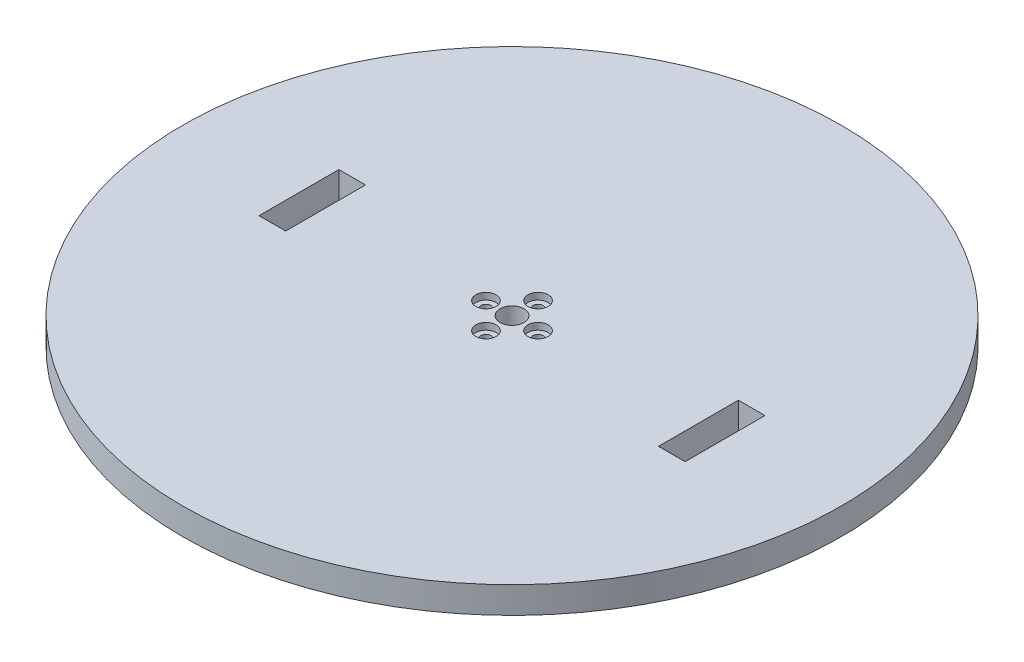
ISO-10303-21;
HEADER;
FILE_DESCRIPTION(('STEP AP214'),'2;1');
FILE_NAME('part.step','',(''),(''),'','','');
FILE_SCHEMA(('AUTOMOTIVE_DESIGN { 1 0 10303 214 1 1 1 1 }'));
ENDSEC;
DATA;
#1=APPLICATION_CONTEXT('core data for automotive mechanical design processes');
#2=APPLICATION_PROTOCOL_DEFINITION('international standard','automotive_design',2000,#1);
#3=PRODUCT_CONTEXT('',#1,'mechanical');
#4=PRODUCT('Part','Part','',(#3));
#5=PRODUCT_RELATED_PRODUCT_CATEGORY('part','',(#4));
#6=PRODUCT_DEFINITION_FORMATION('','',#4);
#7=PRODUCT_DEFINITION_CONTEXT('part definition',#1,'design');
#8=PRODUCT_DEFINITION('design','',#6,#7);
#9=PRODUCT_DEFINITION_SHAPE('','',#8);
#10=(LENGTH_UNIT() NAMED_UNIT(*) SI_UNIT(.MILLI.,.METRE.));
#11=(NAMED_UNIT(*) PLANE_ANGLE_UNIT() SI_UNIT($,.RADIAN.));
#12=(NAMED_UNIT(*) SI_UNIT($,.STERADIAN.) SOLID_ANGLE_UNIT());
#13=UNCERTAINTY_MEASURE_WITH_UNIT(LENGTH_MEASURE(1.E-05),#10,'distance_accuracy_value','');
#14=(GEOMETRIC_REPRESENTATION_CONTEXT(3) GLOBAL_UNCERTAINTY_ASSIGNED_CONTEXT((#13)) GLOBAL_UNIT_ASSIGNED_CONTEXT((#10,
#11,#12)) REPRESENTATION_CONTEXT('',''));
#15=CARTESIAN_POINT('',(0.,0.,0.));
#16=DIRECTION('',(0.,0.,1.));
#17=DIRECTION('',(1.,0.,0.));
#18=AXIS2_PLACEMENT_3D('',#15,#16,#17);
#19=CARTESIAN_POINT('',(-9.779,0.,-1.02429588037641E-13));
#20=DIRECTION('',(0.,1.,0.));
#21=DIRECTION('',(0.,0.,1.));
#22=AXIS2_PLACEMENT_3D('',#19,#20,#21);
#23=CYLINDRICAL_SURFACE('',#22,1.905);
#24=CARTESIAN_POINT('',(-9.779,0.,-1.02429588037641E-13));
#25=DIRECTION('',(0.,1.,0.));
#26=DIRECTION('',(1.,0.,0.));
#27=AXIS2_PLACEMENT_3D('',#24,#25,#26);
#28=CIRCLE('',#27,1.905);
#29=CARTESIAN_POINT('',(-7.874,0.,0.));
#30=VERTEX_POINT('',#29);
#31=EDGE_CURVE('E242',#30,#30,#28,.T.);
#32=ORIENTED_EDGE('',*,*,#31,.F.);
#33=EDGE_LOOP('',(#32));
#34=FACE_BOUND('',#33,.T.);
#35=CARTESIAN_POINT('',(-9.779,7.46,-1.02429588037641E-13));
#36=DIRECTION('',(0.,1.,0.));
#37=DIRECTION('',(0.,0.,1.));
#38=AXIS2_PLACEMENT_3D('',#35,#36,#37);
#39=CIRCLE('',#38,1.905);
#40=CARTESIAN_POINT('',(-9.779,7.46,1.9049999999999));
#41=VERTEX_POINT('',#40);
#42=EDGE_CURVE('E47',#41,#41,#39,.F.);
#43=ORIENTED_EDGE('',*,*,#42,.F.);
#44=EDGE_LOOP('',(#43));
#45=FACE_BOUND('',#44,.T.);
#46=ADVANCED_FACE('F43',(#34,#45),#23,.F.);
#47=CARTESIAN_POINT('',(0.,0.,9.779));
#48=DIRECTION('',(0.,1.,0.));
#49=DIRECTION('',(0.,0.,1.));
#50=AXIS2_PLACEMENT_3D('',#47,#48,#49);
#51=CYLINDRICAL_SURFACE('',#50,1.905);
#52=CARTESIAN_POINT('',(0.,0.,9.779));
#53=DIRECTION('',(0.,1.,0.));
#54=DIRECTION('',(0.,0.,-1.));
#55=AXIS2_PLACEMENT_3D('',#52,#53,#54);
#56=CIRCLE('',#55,1.905);
#57=CARTESIAN_POINT('',(0.,0.,7.874));
#58=VERTEX_POINT('',#57);
#59=EDGE_CURVE('E252',#58,#58,#56,.T.);
#60=ORIENTED_EDGE('',*,*,#59,.F.);
#61=EDGE_LOOP('',(#60));
#62=FACE_BOUND('',#61,.T.);
#63=CARTESIAN_POINT('',(0.,7.46,9.779));
#64=DIRECTION('',(0.,1.,0.));
#65=DIRECTION('',(0.,0.,1.));
#66=AXIS2_PLACEMENT_3D('',#63,#64,#65);
#67=CIRCLE('',#66,1.905);
#68=CARTESIAN_POINT('',(0.,7.46,11.684));
#69=VERTEX_POINT('',#68);
#70=EDGE_CURVE('E270',#69,#69,#67,.F.);
#71=ORIENTED_EDGE('',*,*,#70,.F.);
#72=EDGE_LOOP('',(#71));
#73=FACE_BOUND('',#72,.T.);
#74=ADVANCED_FACE('F282',(#62,#73),#51,.F.);
#75=CARTESIAN_POINT('',(9.779,0.,0.));
#76=DIRECTION('',(0.,1.,0.));
#77=DIRECTION('',(0.,0.,1.));
#78=AXIS2_PLACEMENT_3D('',#75,#76,#77);
#79=CYLINDRICAL_SURFACE('',#78,1.905);
#80=CARTESIAN_POINT('',(9.779,0.,0.));
#81=DIRECTION('',(0.,1.,0.));
#82=DIRECTION('',(-1.,0.,0.));
#83=AXIS2_PLACEMENT_3D('',#80,#81,#82);
#84=CIRCLE('',#83,1.905);
#85=CARTESIAN_POINT('',(7.874,0.,0.));
#86=VERTEX_POINT('',#85);
#87=EDGE_CURVE('E247',#86,#86,#84,.T.);
#88=ORIENTED_EDGE('',*,*,#87,.F.);
#89=EDGE_LOOP('',(#88));
#90=FACE_BOUND('',#89,.T.);
#91=CARTESIAN_POINT('',(9.779,7.46,0.));
#92=DIRECTION('',(0.,1.,0.));
#93=DIRECTION('',(0.,0.,1.));
#94=AXIS2_PLACEMENT_3D('',#91,#92,#93);
#95=CIRCLE('',#94,1.905);
#96=CARTESIAN_POINT('',(9.779,7.46,1.90500000000003));
#97=VERTEX_POINT('',#96);
#98=EDGE_CURVE('E209',#97,#97,#95,.F.);
#99=ORIENTED_EDGE('',*,*,#98,.F.);
#100=EDGE_LOOP('',(#99));
#101=FACE_BOUND('',#100,.T.);
#102=ADVANCED_FACE('F288',(#90,#101),#79,.F.);
#103=CARTESIAN_POINT('',(0.,0.,-9.779));
#104=DIRECTION('',(0.,1.,0.));
#105=DIRECTION('',(0.,0.,1.));
#106=AXIS2_PLACEMENT_3D('',#103,#104,#105);
#107=CYLINDRICAL_SURFACE('',#106,1.905);
#108=CARTESIAN_POINT('',(0.,0.,-9.779));
#109=DIRECTION('',(0.,1.,0.));
#110=DIRECTION('',(0.,0.,1.));
#111=AXIS2_PLACEMENT_3D('',#108,#109,#110);
#112=CIRCLE('',#111,1.905);
#113=CARTESIAN_POINT('',(0.,0.,-7.874));
#114=VERTEX_POINT('',#113);
#115=EDGE_CURVE('E251',#114,#114,#112,.T.);
#116=ORIENTED_EDGE('',*,*,#115,.F.);
#117=EDGE_LOOP('',(#116));
#118=FACE_BOUND('',#117,.T.);
#119=CARTESIAN_POINT('',(0.,7.46,-9.779));
#120=DIRECTION('',(0.,1.,0.));
#121=DIRECTION('',(0.,0.,1.));
#122=AXIS2_PLACEMENT_3D('',#119,#120,#121);
#123=CIRCLE('',#122,1.905);
#124=CARTESIAN_POINT('',(0.,7.46,-7.874));
#125=VERTEX_POINT('',#124);
#126=EDGE_CURVE('E233',#125,#125,#123,.F.);
#127=ORIENTED_EDGE('',*,*,#126,.F.);
#128=EDGE_LOOP('',(#127));
#129=FACE_BOUND('',#128,.T.);
#130=ADVANCED_FACE('F294',(#118,#129),#107,.F.);
#131=CARTESIAN_POINT('',(0.,10.,0.));
#132=DIRECTION('',(0.,-1.,0.));
#133=DIRECTION('',(0.,0.,-1.));
#134=AXIS2_PLACEMENT_3D('',#131,#132,#133);
#135=CYLINDRICAL_SURFACE('',#134,123.75);
#136=CARTESIAN_POINT('',(0.,10.,0.));
#137=DIRECTION('',(0.,1.,0.));
#138=DIRECTION('',(0.,0.,1.));
#139=AXIS2_PLACEMENT_3D('',#136,#137,#138);
#140=CIRCLE('',#139,123.75);
#141=CARTESIAN_POINT('',(0.,10.,123.75));
#142=VERTEX_POINT('',#141);
#143=EDGE_CURVE('E11',#142,#142,#140,.T.);
#144=ORIENTED_EDGE('',*,*,#143,.F.);
#145=EDGE_LOOP('',(#144));
#146=FACE_BOUND('',#145,.T.);
#147=CARTESIAN_POINT('',(0.,0.,0.));
#148=DIRECTION('',(0.,1.,0.));
#149=DIRECTION('',(0.,0.,1.));
#150=AXIS2_PLACEMENT_3D('',#147,#148,#149);
#151=CIRCLE('',#150,123.75);
#152=CARTESIAN_POINT('',(0.,0.,123.75));
#153=VERTEX_POINT('',#152);
#154=EDGE_CURVE('E53',#153,#153,#151,.T.);
#155=ORIENTED_EDGE('',*,*,#154,.T.);
#156=EDGE_LOOP('',(#155));
#157=FACE_BOUND('',#156,.T.);
#158=ADVANCED_FACE('F45',(#146,#157),#135,.T.);
#159=CARTESIAN_POINT('',(0.,10.,0.));
#160=DIRECTION('',(0.,1.,0.));
#161=DIRECTION('',(0.,0.,1.));
#162=AXIS2_PLACEMENT_3D('',#159,#160,#161);
#163=PLANE('',#162);
#164=DIRECTION('',(0.,0.,-1.));
#165=VECTOR('',#164,1.);
#166=CARTESIAN_POINT('',(80.,10.,15.));
#167=LINE('',#166,#165);
#168=CARTESIAN_POINT('',(80.,10.,15.));
#169=VERTEX_POINT('',#168);
#170=CARTESIAN_POINT('',(80.,10.,-15.));
#171=VERTEX_POINT('',#170);
#172=EDGE_CURVE('E61',#169,#171,#167,.T.);
#173=ORIENTED_EDGE('',*,*,#172,.F.);
#174=DIRECTION('',(1.,0.,0.));
#175=VECTOR('',#174,1.);
#176=CARTESIAN_POINT('',(80.,10.,15.));
#177=LINE('',#176,#175);
#178=CARTESIAN_POINT('',(70.,10.,15.));
#179=VERTEX_POINT('',#178);
#180=EDGE_CURVE('E135',#179,#169,#177,.T.);
#181=ORIENTED_EDGE('',*,*,#180,.F.);
#182=DIRECTION('',(0.,0.,1.));
#183=VECTOR('',#182,1.);
#184=CARTESIAN_POINT('',(70.,10.,15.));
#185=LINE('',#184,#183);
#186=CARTESIAN_POINT('',(70.,10.,-15.));
#187=VERTEX_POINT('',#186);
#188=EDGE_CURVE('E139',#187,#179,#185,.T.);
#189=ORIENTED_EDGE('',*,*,#188,.F.);
#190=DIRECTION('',(-1.,0.,0.));
#191=VECTOR('',#190,1.);
#192=CARTESIAN_POINT('',(80.,10.,-15.));
#193=LINE('',#192,#191);
#194=EDGE_CURVE('E148',#171,#187,#193,.T.);
#195=ORIENTED_EDGE('',*,*,#194,.F.);
#196=EDGE_LOOP('',(#173,#181,#189,#195));
#197=FACE_BOUND('',#196,.T.);
#198=DIRECTION('',(0.,0.,1.));
#199=VECTOR('',#198,1.);
#200=CARTESIAN_POINT('',(-80.,10.,15.));
#201=LINE('',#200,#199);
#202=CARTESIAN_POINT('',(-80.,10.,-15.));
#203=VERTEX_POINT('',#202);
#204=CARTESIAN_POINT('',(-80.,10.,15.));
#205=VERTEX_POINT('',#204);
#206=EDGE_CURVE('E69',#203,#205,#201,.T.);
#207=ORIENTED_EDGE('',*,*,#206,.F.);
#208=DIRECTION('',(-1.,0.,0.));
#209=VECTOR('',#208,1.);
#210=CARTESIAN_POINT('',(-80.,10.,-15.));
#211=LINE('',#210,#209);
#212=CARTESIAN_POINT('',(-70.,10.,-15.));
#213=VERTEX_POINT('',#212);
#214=EDGE_CURVE('E169',#213,#203,#211,.T.);
#215=ORIENTED_EDGE('',*,*,#214,.F.);
#216=DIRECTION('',(0.,0.,-1.));
#217=VECTOR('',#216,1.);
#218=CARTESIAN_POINT('',(-70.,10.,15.));
#219=LINE('',#218,#217);
#220=CARTESIAN_POINT('',(-70.,10.,15.));
#221=VERTEX_POINT('',#220);
#222=EDGE_CURVE('E188',#221,#213,#219,.T.);
#223=ORIENTED_EDGE('',*,*,#222,.F.);
#224=DIRECTION('',(1.,0.,0.));
#225=VECTOR('',#224,1.);
#226=CARTESIAN_POINT('',(-80.,10.,15.));
#227=LINE('',#226,#225);
#228=EDGE_CURVE('E184',#205,#221,#227,.T.);
#229=ORIENTED_EDGE('',*,*,#228,.F.);
#230=EDGE_LOOP('',(#207,#215,#223,#229));
#231=FACE_BOUND('',#230,.T.);
#232=CARTESIAN_POINT('',(9.779,10.,0.));
#233=DIRECTION('',(0.,1.,0.));
#234=DIRECTION('',(-1.,0.,0.));
#235=AXIS2_PLACEMENT_3D('',#232,#233,#234);
#236=CIRCLE('',#235,3.81);
#237=CARTESIAN_POINT('',(5.969,10.,0.));
#238=VERTEX_POINT('',#237);
#239=EDGE_CURVE('E210',#238,#238,#236,.T.);
#240=ORIENTED_EDGE('',*,*,#239,.F.);
#241=EDGE_LOOP('',(#240));
#242=FACE_BOUND('',#241,.T.);
#243=CARTESIAN_POINT('',(0.,10.,9.779));
#244=DIRECTION('',(0.,1.,0.));
#245=DIRECTION('',(0.,0.,-1.));
#246=AXIS2_PLACEMENT_3D('',#243,#244,#245);
#247=CIRCLE('',#246,3.81);
#248=CARTESIAN_POINT('',(0.,10.,5.969));
#249=VERTEX_POINT('',#248);
#250=EDGE_CURVE('E218',#249,#249,#247,.T.);
#251=ORIENTED_EDGE('',*,*,#250,.F.);
#252=EDGE_LOOP('',(#251));
#253=FACE_BOUND('',#252,.T.);
#254=CARTESIAN_POINT('',(-9.779,10.,-1.02429588037641E-13));
#255=DIRECTION('',(0.,1.,0.));
#256=DIRECTION('',(1.,0.,0.));
#257=AXIS2_PLACEMENT_3D('',#254,#255,#256);
#258=CIRCLE('',#257,3.81);
#259=CARTESIAN_POINT('',(-5.969,10.,0.));
#260=VERTEX_POINT('',#259);
#261=EDGE_CURVE('E158',#260,#260,#258,.T.);
#262=ORIENTED_EDGE('',*,*,#261,.F.);
#263=EDGE_LOOP('',(#262));
#264=FACE_BOUND('',#263,.T.);
#265=CARTESIAN_POINT('',(0.,10.,-9.779));
#266=DIRECTION('',(0.,1.,0.));
#267=DIRECTION('',(0.,0.,1.));
#268=AXIS2_PLACEMENT_3D('',#265,#266,#267);
#269=CIRCLE('',#268,3.81);
#270=CARTESIAN_POINT('',(0.,10.,-5.969));
#271=VERTEX_POINT('',#270);
#272=EDGE_CURVE('E234',#271,#271,#269,.T.);
#273=ORIENTED_EDGE('',*,*,#272,.F.);
#274=EDGE_LOOP('',(#273));
#275=FACE_BOUND('',#274,.T.);
#276=CARTESIAN_POINT('',(0.,10.,0.));
#277=DIRECTION('',(0.,1.,0.));
#278=DIRECTION('',(0.,0.,1.));
#279=AXIS2_PLACEMENT_3D('',#276,#277,#278);
#280=CIRCLE('',#279,4.5);
#281=CARTESIAN_POINT('',(0.,10.,4.5));
#282=VERTEX_POINT('',#281);
#283=EDGE_CURVE('E243',#282,#282,#280,.T.);
#284=ORIENTED_EDGE('',*,*,#283,.F.);
#285=EDGE_LOOP('',(#284));
#286=FACE_BOUND('',#285,.T.);
#287=ORIENTED_EDGE('',*,*,#143,.T.);
#288=EDGE_LOOP('',(#287));
#289=FACE_BOUND('',#288,.T.);
#290=ADVANCED_FACE('F298',(#197,#231,#242,#253,#264,#275,#286,#289),#163,.T.);
#291=CARTESIAN_POINT('',(0.,0.,0.));
#292=DIRECTION('',(0.,1.,0.));
#293=DIRECTION('',(0.,0.,1.));
#294=AXIS2_PLACEMENT_3D('',#291,#292,#293);
#295=PLANE('',#294);
#296=DIRECTION('',(1.,0.,0.));
#297=VECTOR('',#296,1.);
#298=CARTESIAN_POINT('',(80.,0.,15.));
#299=LINE('',#298,#297);
#300=CARTESIAN_POINT('',(70.,0.,15.));
#301=VERTEX_POINT('',#300);
#302=CARTESIAN_POINT('',(80.,0.,15.));
#303=VERTEX_POINT('',#302);
#304=EDGE_CURVE('E120',#301,#303,#299,.T.);
#305=ORIENTED_EDGE('',*,*,#304,.T.);
#306=DIRECTION('',(0.,0.,-1.));
#307=VECTOR('',#306,1.);
#308=CARTESIAN_POINT('',(80.,0.,15.));
#309=LINE('',#308,#307);
#310=CARTESIAN_POINT('',(80.,0.,-15.));
#311=VERTEX_POINT('',#310);
#312=EDGE_CURVE('E113',#303,#311,#309,.T.);
#313=ORIENTED_EDGE('',*,*,#312,.T.);
#314=DIRECTION('',(-1.,0.,0.));
#315=VECTOR('',#314,1.);
#316=CARTESIAN_POINT('',(80.,0.,-15.));
#317=LINE('',#316,#315);
#318=CARTESIAN_POINT('',(70.,0.,-15.));
#319=VERTEX_POINT('',#318);
#320=EDGE_CURVE('E124',#311,#319,#317,.T.);
#321=ORIENTED_EDGE('',*,*,#320,.T.);
#322=DIRECTION('',(0.,0.,1.));
#323=VECTOR('',#322,1.);
#324=CARTESIAN_POINT('',(70.,0.,15.));
#325=LINE('',#324,#323);
#326=EDGE_CURVE('E129',#319,#301,#325,.T.);
#327=ORIENTED_EDGE('',*,*,#326,.T.);
#328=EDGE_LOOP('',(#305,#313,#321,#327));
#329=FACE_BOUND('',#328,.T.);
#330=DIRECTION('',(-1.,0.,0.));
#331=VECTOR('',#330,1.);
#332=CARTESIAN_POINT('',(-80.,0.,-15.));
#333=LINE('',#332,#331);
#334=CARTESIAN_POINT('',(-70.,0.,-15.));
#335=VERTEX_POINT('',#334);
#336=CARTESIAN_POINT('',(-80.,0.,-15.));
#337=VERTEX_POINT('',#336);
#338=EDGE_CURVE('E177',#335,#337,#333,.T.);
#339=ORIENTED_EDGE('',*,*,#338,.T.);
#340=DIRECTION('',(0.,0.,1.));
#341=VECTOR('',#340,1.);
#342=CARTESIAN_POINT('',(-80.,0.,15.));
#343=LINE('',#342,#341);
#344=CARTESIAN_POINT('',(-80.,0.,15.));
#345=VERTEX_POINT('',#344);
#346=EDGE_CURVE('E164',#337,#345,#343,.T.);
#347=ORIENTED_EDGE('',*,*,#346,.T.);
#348=DIRECTION('',(1.,0.,0.));
#349=VECTOR('',#348,1.);
#350=CARTESIAN_POINT('',(-80.,0.,15.));
#351=LINE('',#350,#349);
#352=CARTESIAN_POINT('',(-70.,0.,15.));
#353=VERTEX_POINT('',#352);
#354=EDGE_CURVE('E168',#345,#353,#351,.T.);
#355=ORIENTED_EDGE('',*,*,#354,.T.);
#356=DIRECTION('',(0.,0.,-1.));
#357=VECTOR('',#356,1.);
#358=CARTESIAN_POINT('',(-70.,0.,15.));
#359=LINE('',#358,#357);
#360=EDGE_CURVE('E173',#353,#335,#359,.T.);
#361=ORIENTED_EDGE('',*,*,#360,.T.);
#362=EDGE_LOOP('',(#339,#347,#355,#361));
#363=FACE_BOUND('',#362,.T.);
#364=CARTESIAN_POINT('',(0.,0.,0.));
#365=DIRECTION('',(0.,1.,0.));
#366=DIRECTION('',(0.,0.,1.));
#367=AXIS2_PLACEMENT_3D('',#364,#365,#366);
#368=CIRCLE('',#367,4.5);
#369=CARTESIAN_POINT('',(0.,0.,4.5));
#370=VERTEX_POINT('',#369);
#371=EDGE_CURVE('E238',#370,#370,#368,.T.);
#372=ORIENTED_EDGE('',*,*,#371,.T.);
#373=EDGE_LOOP('',(#372));
#374=FACE_BOUND('',#373,.T.);
#375=ORIENTED_EDGE('',*,*,#87,.T.);
#376=EDGE_LOOP('',(#375));
#377=FACE_BOUND('',#376,.T.);
#378=ORIENTED_EDGE('',*,*,#59,.T.);
#379=EDGE_LOOP('',(#378));
#380=FACE_BOUND('',#379,.T.);
#381=ORIENTED_EDGE('',*,*,#31,.T.);
#382=EDGE_LOOP('',(#381));
#383=FACE_BOUND('',#382,.T.);
#384=ORIENTED_EDGE('',*,*,#115,.T.);
#385=EDGE_LOOP('',(#384));
#386=FACE_BOUND('',#385,.T.);
#387=ORIENTED_EDGE('',*,*,#154,.F.);
#388=EDGE_LOOP('',(#387));
#389=FACE_BOUND('',#388,.T.);
#390=ADVANCED_FACE('F131',(#329,#363,#374,#377,#380,#383,#386,#389),#295,.F.);
#391=CARTESIAN_POINT('',(0.,0.,0.));
#392=DIRECTION('',(0.,1.,0.));
#393=DIRECTION('',(0.,0.,1.));
#394=AXIS2_PLACEMENT_3D('',#391,#392,#393);
#395=CYLINDRICAL_SURFACE('',#394,4.5);
#396=ORIENTED_EDGE('',*,*,#371,.F.);
#397=EDGE_LOOP('',(#396));
#398=FACE_BOUND('',#397,.T.);
#399=ORIENTED_EDGE('',*,*,#283,.T.);
#400=EDGE_LOOP('',(#399));
#401=FACE_BOUND('',#400,.T.);
#402=ADVANCED_FACE('F302',(#398,#401),#395,.F.);
#403=CARTESIAN_POINT('',(0.,7.46,-9.779));
#404=DIRECTION('',(0.,1.,0.));
#405=DIRECTION('',(0.,0.,1.));
#406=AXIS2_PLACEMENT_3D('',#403,#404,#405);
#407=PLANE('',#406);
#408=CARTESIAN_POINT('',(0.,7.46,-9.779));
#409=DIRECTION('',(0.,1.,0.));
#410=DIRECTION('',(0.,0.,1.));
#411=AXIS2_PLACEMENT_3D('',#408,#409,#410);
#412=CIRCLE('',#411,3.81);
#413=CARTESIAN_POINT('',(0.,7.46,-5.969));
#414=VERTEX_POINT('',#413);
#415=EDGE_CURVE('E229',#414,#414,#412,.T.);
#416=ORIENTED_EDGE('',*,*,#415,.T.);
#417=EDGE_LOOP('',(#416));
#418=FACE_BOUND('',#417,.T.);
#419=ORIENTED_EDGE('',*,*,#126,.T.);
#420=EDGE_LOOP('',(#419));
#421=FACE_BOUND('',#420,.T.);
#422=ADVANCED_FACE('F306',(#418,#421),#407,.T.);
#423=CARTESIAN_POINT('',(0.,7.46,-9.779));
#424=DIRECTION('',(0.,1.,0.));
#425=DIRECTION('',(0.,0.,1.));
#426=AXIS2_PLACEMENT_3D('',#423,#424,#425);
#427=CYLINDRICAL_SURFACE('',#426,3.81);
#428=ORIENTED_EDGE('',*,*,#415,.F.);
#429=EDGE_LOOP('',(#428));
#430=FACE_BOUND('',#429,.T.);
#431=ORIENTED_EDGE('',*,*,#272,.T.);
#432=EDGE_LOOP('',(#431));
#433=FACE_BOUND('',#432,.T.);
#434=ADVANCED_FACE('F312',(#430,#433),#427,.F.);
#435=CARTESIAN_POINT('',(9.779,7.46,0.));
#436=DIRECTION('',(0.,1.,0.));
#437=DIRECTION('',(-1.,0.,0.));
#438=AXIS2_PLACEMENT_3D('',#435,#436,#437);
#439=PLANE('',#438);
#440=CARTESIAN_POINT('',(9.779,7.46,0.));
#441=DIRECTION('',(0.,1.,0.));
#442=DIRECTION('',(-1.,0.,0.));
#443=AXIS2_PLACEMENT_3D('',#440,#441,#442);
#444=CIRCLE('',#443,3.81);
#445=CARTESIAN_POINT('',(5.969,7.46,0.));
#446=VERTEX_POINT('',#445);
#447=EDGE_CURVE('E205',#446,#446,#444,.T.);
#448=ORIENTED_EDGE('',*,*,#447,.T.);
#449=EDGE_LOOP('',(#448));
#450=FACE_BOUND('',#449,.T.);
#451=ORIENTED_EDGE('',*,*,#98,.T.);
#452=EDGE_LOOP('',(#451));
#453=FACE_BOUND('',#452,.T.);
#454=ADVANCED_FACE('F326',(#450,#453),#439,.T.);
#455=CARTESIAN_POINT('',(9.779,7.46,0.));
#456=DIRECTION('',(0.,1.,0.));
#457=DIRECTION('',(0.,0.,1.));
#458=AXIS2_PLACEMENT_3D('',#455,#456,#457);
#459=CYLINDRICAL_SURFACE('',#458,3.81);
#460=ORIENTED_EDGE('',*,*,#447,.F.);
#461=EDGE_LOOP('',(#460));
#462=FACE_BOUND('',#461,.T.);
#463=ORIENTED_EDGE('',*,*,#239,.T.);
#464=EDGE_LOOP('',(#463));
#465=FACE_BOUND('',#464,.T.);
#466=ADVANCED_FACE('F328',(#462,#465),#459,.F.);
#467=CARTESIAN_POINT('',(0.,7.46,9.779));
#468=DIRECTION('',(0.,1.,0.));
#469=DIRECTION('',(0.,0.,-1.));
#470=AXIS2_PLACEMENT_3D('',#467,#468,#469);
#471=PLANE('',#470);
#472=CARTESIAN_POINT('',(0.,7.46,9.779));
#473=DIRECTION('',(0.,1.,0.));
#474=DIRECTION('',(0.,0.,-1.));
#475=AXIS2_PLACEMENT_3D('',#472,#473,#474);
#476=CIRCLE('',#475,3.81);
#477=CARTESIAN_POINT('',(0.,7.46,5.969));
#478=VERTEX_POINT('',#477);
#479=EDGE_CURVE('E214',#478,#478,#476,.T.);
#480=ORIENTED_EDGE('',*,*,#479,.T.);
#481=EDGE_LOOP('',(#480));
#482=FACE_BOUND('',#481,.T.);
#483=ORIENTED_EDGE('',*,*,#70,.T.);
#484=EDGE_LOOP('',(#483));
#485=FACE_BOUND('',#484,.T.);
#486=ADVANCED_FACE('F335',(#482,#485),#471,.T.);
#487=CARTESIAN_POINT('',(0.,7.46,9.779));
#488=DIRECTION('',(0.,1.,0.));
#489=DIRECTION('',(0.,0.,1.));
#490=AXIS2_PLACEMENT_3D('',#487,#488,#489);
#491=CYLINDRICAL_SURFACE('',#490,3.81);
#492=ORIENTED_EDGE('',*,*,#479,.F.);
#493=EDGE_LOOP('',(#492));
#494=FACE_BOUND('',#493,.T.);
#495=ORIENTED_EDGE('',*,*,#250,.T.);
#496=EDGE_LOOP('',(#495));
#497=FACE_BOUND('',#496,.T.);
#498=ADVANCED_FACE('F345',(#494,#497),#491,.F.);
#499=CARTESIAN_POINT('',(-9.779,7.46,-1.02429588037641E-13));
#500=DIRECTION('',(0.,1.,0.));
#501=DIRECTION('',(1.,0.,0.));
#502=AXIS2_PLACEMENT_3D('',#499,#500,#501);
#503=PLANE('',#502);
#504=CARTESIAN_POINT('',(-9.779,7.46,-1.02429588037641E-13));
#505=DIRECTION('',(0.,1.,0.));
#506=DIRECTION('',(1.,0.,0.));
#507=AXIS2_PLACEMENT_3D('',#504,#505,#506);
#508=CIRCLE('',#507,3.81);
#509=CARTESIAN_POINT('',(-5.969,7.46,0.));
#510=VERTEX_POINT('',#509);
#511=EDGE_CURVE('E222',#510,#510,#508,.T.);
#512=ORIENTED_EDGE('',*,*,#511,.T.);
#513=EDGE_LOOP('',(#512));
#514=FACE_BOUND('',#513,.T.);
#515=ORIENTED_EDGE('',*,*,#42,.T.);
#516=EDGE_LOOP('',(#515));
#517=FACE_BOUND('',#516,.T.);
#518=ADVANCED_FACE('F279',(#514,#517),#503,.T.);
#519=CARTESIAN_POINT('',(-9.779,7.46,-1.02429588037641E-13));
#520=DIRECTION('',(0.,1.,0.));
#521=DIRECTION('',(0.,0.,1.));
#522=AXIS2_PLACEMENT_3D('',#519,#520,#521);
#523=CYLINDRICAL_SURFACE('',#522,3.81);
#524=ORIENTED_EDGE('',*,*,#511,.F.);
#525=EDGE_LOOP('',(#524));
#526=FACE_BOUND('',#525,.T.);
#527=ORIENTED_EDGE('',*,*,#261,.T.);
#528=EDGE_LOOP('',(#527));
#529=FACE_BOUND('',#528,.T.);
#530=ADVANCED_FACE('F352',(#526,#529),#523,.F.);
#531=CARTESIAN_POINT('',(-80.,0.,15.));
#532=DIRECTION('',(-1.,0.,0.));
#533=DIRECTION('',(0.,0.,1.));
#534=AXIS2_PLACEMENT_3D('',#531,#532,#533);
#535=PLANE('',#534);
#536=ORIENTED_EDGE('',*,*,#206,.T.);
#537=DIRECTION('',(0.,1.,0.));
#538=VECTOR('',#537,1.);
#539=CARTESIAN_POINT('',(-80.,0.,15.));
#540=LINE('',#539,#538);
#541=EDGE_CURVE('E181',#345,#205,#540,.T.);
#542=ORIENTED_EDGE('',*,*,#541,.F.);
#543=ORIENTED_EDGE('',*,*,#346,.F.);
#544=DIRECTION('',(0.,1.,0.));
#545=VECTOR('',#544,1.);
#546=CARTESIAN_POINT('',(-80.,0.,-15.));
#547=LINE('',#546,#545);
#548=EDGE_CURVE('E149',#337,#203,#547,.T.);
#549=ORIENTED_EDGE('',*,*,#548,.T.);
#550=EDGE_LOOP('',(#536,#542,#543,#549));
#551=FACE_BOUND('',#550,.T.);
#552=ADVANCED_FACE('F340',(#551),#535,.F.);
#553=CARTESIAN_POINT('',(-80.,0.,-15.));
#554=DIRECTION('',(0.,0.,-1.));
#555=DIRECTION('',(-1.,0.,0.));
#556=AXIS2_PLACEMENT_3D('',#553,#554,#555);
#557=PLANE('',#556);
#558=ORIENTED_EDGE('',*,*,#214,.T.);
#559=ORIENTED_EDGE('',*,*,#548,.F.);
#560=ORIENTED_EDGE('',*,*,#338,.F.);
#561=DIRECTION('',(0.,1.,0.));
#562=VECTOR('',#561,1.);
#563=CARTESIAN_POINT('',(-70.,0.,-15.));
#564=LINE('',#563,#562);
#565=EDGE_CURVE('E197',#335,#213,#564,.T.);
#566=ORIENTED_EDGE('',*,*,#565,.T.);
#567=EDGE_LOOP('',(#558,#559,#560,#566));
#568=FACE_BOUND('',#567,.T.);
#569=ADVANCED_FACE('F359',(#568),#557,.F.);
#570=CARTESIAN_POINT('',(-70.,0.,15.));
#571=DIRECTION('',(1.,0.,0.));
#572=DIRECTION('',(0.,0.,-1.));
#573=AXIS2_PLACEMENT_3D('',#570,#571,#572);
#574=PLANE('',#573);
#575=ORIENTED_EDGE('',*,*,#222,.T.);
#576=ORIENTED_EDGE('',*,*,#565,.F.);
#577=ORIENTED_EDGE('',*,*,#360,.F.);
#578=DIRECTION('',(0.,1.,0.));
#579=VECTOR('',#578,1.);
#580=CARTESIAN_POINT('',(-70.,0.,15.));
#581=LINE('',#580,#579);
#582=EDGE_CURVE('E200',#353,#221,#581,.T.);
#583=ORIENTED_EDGE('',*,*,#582,.T.);
#584=EDGE_LOOP('',(#575,#576,#577,#583));
#585=FACE_BOUND('',#584,.T.);
#586=ADVANCED_FACE('F406',(#585),#574,.F.);
#587=CARTESIAN_POINT('',(-80.,0.,15.));
#588=DIRECTION('',(0.,0.,1.));
#589=DIRECTION('',(1.,0.,0.));
#590=AXIS2_PLACEMENT_3D('',#587,#588,#589);
#591=PLANE('',#590);
#592=ORIENTED_EDGE('',*,*,#228,.T.);
#593=ORIENTED_EDGE('',*,*,#582,.F.);
#594=ORIENTED_EDGE('',*,*,#354,.F.);
#595=ORIENTED_EDGE('',*,*,#541,.T.);
#596=EDGE_LOOP('',(#592,#593,#594,#595));
#597=FACE_BOUND('',#596,.T.);
#598=ADVANCED_FACE('F416',(#597),#591,.F.);
#599=CARTESIAN_POINT('',(80.,0.,15.));
#600=DIRECTION('',(1.,0.,0.));
#601=DIRECTION('',(0.,0.,-1.));
#602=AXIS2_PLACEMENT_3D('',#599,#600,#601);
#603=PLANE('',#602);
#604=ORIENTED_EDGE('',*,*,#172,.T.);
#605=DIRECTION('',(0.,1.,0.));
#606=VECTOR('',#605,1.);
#607=CARTESIAN_POINT('',(80.,0.,-15.));
#608=LINE('',#607,#606);
#609=EDGE_CURVE('E109',#311,#171,#608,.T.);
#610=ORIENTED_EDGE('',*,*,#609,.F.);
#611=ORIENTED_EDGE('',*,*,#312,.F.);
#612=DIRECTION('',(0.,1.,0.));
#613=VECTOR('',#612,1.);
#614=CARTESIAN_POINT('',(80.,0.,15.));
#615=LINE('',#614,#613);
#616=EDGE_CURVE('E155',#303,#169,#615,.T.);
#617=ORIENTED_EDGE('',*,*,#616,.T.);
#618=EDGE_LOOP('',(#604,#610,#611,#617));
#619=FACE_BOUND('',#618,.T.);
#620=ADVANCED_FACE('F111',(#619),#603,.F.);
#621=CARTESIAN_POINT('',(80.,0.,15.));
#622=DIRECTION('',(0.,0.,1.));
#623=DIRECTION('',(1.,0.,0.));
#624=AXIS2_PLACEMENT_3D('',#621,#622,#623);
#625=PLANE('',#624);
#626=ORIENTED_EDGE('',*,*,#180,.T.);
#627=ORIENTED_EDGE('',*,*,#616,.F.);
#628=ORIENTED_EDGE('',*,*,#304,.F.);
#629=DIRECTION('',(0.,1.,0.));
#630=VECTOR('',#629,1.);
#631=CARTESIAN_POINT('',(70.,0.,15.));
#632=LINE('',#631,#630);
#633=EDGE_CURVE('E159',#301,#179,#632,.T.);
#634=ORIENTED_EDGE('',*,*,#633,.T.);
#635=EDGE_LOOP('',(#626,#627,#628,#634));
#636=FACE_BOUND('',#635,.T.);
#637=ADVANCED_FACE('F434',(#636),#625,.F.);
#638=CARTESIAN_POINT('',(70.,0.,15.));
#639=DIRECTION('',(-1.,0.,0.));
#640=DIRECTION('',(0.,0.,1.));
#641=AXIS2_PLACEMENT_3D('',#638,#639,#640);
#642=PLANE('',#641);
#643=ORIENTED_EDGE('',*,*,#188,.T.);
#644=ORIENTED_EDGE('',*,*,#633,.F.);
#645=ORIENTED_EDGE('',*,*,#326,.F.);
#646=DIRECTION('',(0.,1.,0.));
#647=VECTOR('',#646,1.);
#648=CARTESIAN_POINT('',(70.,0.,-15.));
#649=LINE('',#648,#647);
#650=EDGE_CURVE('E119',#319,#187,#649,.T.);
#651=ORIENTED_EDGE('',*,*,#650,.T.);
#652=EDGE_LOOP('',(#643,#644,#645,#651));
#653=FACE_BOUND('',#652,.T.);
#654=ADVANCED_FACE('F443',(#653),#642,.F.);
#655=CARTESIAN_POINT('',(80.,0.,-15.));
#656=DIRECTION('',(0.,0.,-1.));
#657=DIRECTION('',(-1.,0.,0.));
#658=AXIS2_PLACEMENT_3D('',#655,#656,#657);
#659=PLANE('',#658);
#660=ORIENTED_EDGE('',*,*,#194,.T.);
#661=ORIENTED_EDGE('',*,*,#650,.F.);
#662=ORIENTED_EDGE('',*,*,#320,.F.);
#663=ORIENTED_EDGE('',*,*,#609,.T.);
#664=EDGE_LOOP('',(#660,#661,#662,#663));
#665=FACE_BOUND('',#664,.T.);
#666=ADVANCED_FACE('F125',(#665),#659,.F.);
#667=CLOSED_SHELL('',(#46,#74,#102,#130,#158,#290,#390,#402,#422,#434,#454,#466,#486,#498,#518,
#530,#552,#569,#586,#598,#620,#637,#654,#666));
#668=MANIFOLD_SOLID_BREP('B2',#667);
#669=ADVANCED_BREP_SHAPE_REPRESENTATION('',(#18,#668),#14);
#670=SHAPE_DEFINITION_REPRESENTATION(#9,#669);
ENDSEC;
END-ISO-10303-21;
